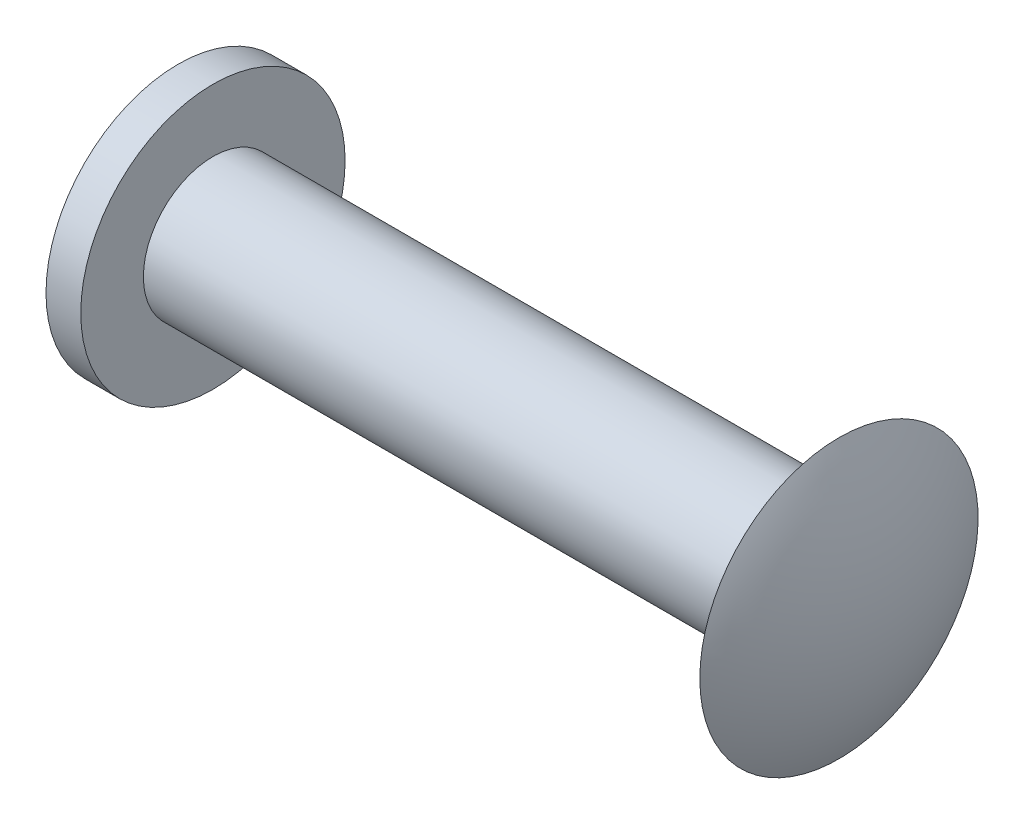
ISO-10303-21;
HEADER;
FILE_DESCRIPTION(('STEP AP214'),'2;1');
FILE_NAME('part.step','',(''),(''),'','','');
FILE_SCHEMA(('AUTOMOTIVE_DESIGN { 1 0 10303 214 1 1 1 1 }'));
ENDSEC;
DATA;
#1=APPLICATION_CONTEXT('core data for automotive mechanical design processes');
#2=APPLICATION_PROTOCOL_DEFINITION('international standard','automotive_design',2000,#1);
#3=PRODUCT_CONTEXT('',#1,'mechanical');
#4=PRODUCT('Part','Part','',(#3));
#5=PRODUCT_RELATED_PRODUCT_CATEGORY('part','',(#4));
#6=PRODUCT_DEFINITION_FORMATION('','',#4);
#7=PRODUCT_DEFINITION_CONTEXT('part definition',#1,'design');
#8=PRODUCT_DEFINITION('design','',#6,#7);
#9=PRODUCT_DEFINITION_SHAPE('','',#8);
#10=(LENGTH_UNIT() NAMED_UNIT(*) SI_UNIT(.MILLI.,.METRE.));
#11=(NAMED_UNIT(*) PLANE_ANGLE_UNIT() SI_UNIT($,.RADIAN.));
#12=(NAMED_UNIT(*) SI_UNIT($,.STERADIAN.) SOLID_ANGLE_UNIT());
#13=UNCERTAINTY_MEASURE_WITH_UNIT(LENGTH_MEASURE(1.E-05),#10,'distance_accuracy_value','');
#14=(GEOMETRIC_REPRESENTATION_CONTEXT(3) GLOBAL_UNCERTAINTY_ASSIGNED_CONTEXT((#13)) GLOBAL_UNIT_ASSIGNED_CONTEXT((#10,
#11,#12)) REPRESENTATION_CONTEXT('',''));
#15=CARTESIAN_POINT('',(0.,0.,0.));
#16=DIRECTION('',(0.,0.,1.));
#17=DIRECTION('',(1.,0.,0.));
#18=AXIS2_PLACEMENT_3D('',#15,#16,#17);
#19=CARTESIAN_POINT('',(0.,0.,0.));
#20=DIRECTION('',(1.,0.,0.));
#21=DIRECTION('',(0.,0.,-1.));
#22=AXIS2_PLACEMENT_3D('',#19,#20,#21);
#23=PLANE('',#22);
#24=CARTESIAN_POINT('',(0.,0.,0.));
#25=DIRECTION('',(-1.,0.,0.));
#26=DIRECTION('',(0.,0.,1.));
#27=AXIS2_PLACEMENT_3D('',#24,#25,#26);
#28=CIRCLE('',#27,1.9);
#29=CARTESIAN_POINT('',(0.,0.,1.9));
#30=VERTEX_POINT('',#29);
#31=EDGE_CURVE('E10',#30,#30,#28,.T.);
#32=ORIENTED_EDGE('',*,*,#31,.T.);
#33=EDGE_LOOP('',(#32));
#34=FACE_BOUND('',#33,.T.);
#35=ADVANCED_FACE('F34',(#34),#23,.F.);
#36=CARTESIAN_POINT('',(9.5,0.,0.));
#37=DIRECTION('',(-1.,0.,0.));
#38=DIRECTION('',(0.,0.,1.));
#39=AXIS2_PLACEMENT_3D('',#36,#37,#38);
#40=CYLINDRICAL_SURFACE('',#39,1.9);
#41=ORIENTED_EDGE('',*,*,#31,.F.);
#42=EDGE_LOOP('',(#41));
#43=FACE_BOUND('',#42,.T.);
#44=CARTESIAN_POINT('',(0.5,0.,0.));
#45=DIRECTION('',(-1.,0.,0.));
#46=DIRECTION('',(0.,0.,1.));
#47=AXIS2_PLACEMENT_3D('',#44,#45,#46);
#48=CIRCLE('',#47,1.9);
#49=CARTESIAN_POINT('',(0.5,0.,1.9));
#50=VERTEX_POINT('',#49);
#51=EDGE_CURVE('E41',#50,#50,#48,.T.);
#52=ORIENTED_EDGE('',*,*,#51,.T.);
#53=EDGE_LOOP('',(#52));
#54=FACE_BOUND('',#53,.T.);
#55=ADVANCED_FACE('F74',(#43,#54),#40,.T.);
#56=CARTESIAN_POINT('',(0.5,1.9,0.));
#57=DIRECTION('',(-1.,0.,0.));
#58=DIRECTION('',(0.,0.,1.));
#59=AXIS2_PLACEMENT_3D('',#56,#57,#58);
#60=PLANE('',#59);
#61=ORIENTED_EDGE('',*,*,#51,.F.);
#62=EDGE_LOOP('',(#61));
#63=FACE_BOUND('',#62,.T.);
#64=CARTESIAN_POINT('',(0.5,0.,0.));
#65=DIRECTION('',(-1.,0.,0.));
#66=DIRECTION('',(0.,0.,1.));
#67=AXIS2_PLACEMENT_3D('',#64,#65,#66);
#68=CIRCLE('',#67,1.);
#69=CARTESIAN_POINT('',(0.5,0.,1.));
#70=VERTEX_POINT('',#69);
#71=EDGE_CURVE('E48',#70,#70,#68,.T.);
#72=ORIENTED_EDGE('',*,*,#71,.T.);
#73=EDGE_LOOP('',(#72));
#74=FACE_BOUND('',#73,.T.);
#75=ADVANCED_FACE('F78',(#63,#74),#60,.F.);
#76=CARTESIAN_POINT('',(9.5,0.,0.));
#77=DIRECTION('',(-1.,0.,0.));
#78=DIRECTION('',(0.,0.,1.));
#79=AXIS2_PLACEMENT_3D('',#76,#77,#78);
#80=CYLINDRICAL_SURFACE('',#79,1.);
#81=ORIENTED_EDGE('',*,*,#71,.F.);
#82=EDGE_LOOP('',(#81));
#83=FACE_BOUND('',#82,.T.);
#84=CARTESIAN_POINT('',(9.5,0.,0.));
#85=DIRECTION('',(-1.,0.,0.));
#86=DIRECTION('',(0.,0.,1.));
#87=AXIS2_PLACEMENT_3D('',#84,#85,#86);
#88=CIRCLE('',#87,1.);
#89=CARTESIAN_POINT('',(9.5,0.,1.));
#90=VERTEX_POINT('',#89);
#91=EDGE_CURVE('E52',#90,#90,#88,.T.);
#92=ORIENTED_EDGE('',*,*,#91,.T.);
#93=EDGE_LOOP('',(#92));
#94=FACE_BOUND('',#93,.T.);
#95=ADVANCED_FACE('F70',(#83,#94),#80,.T.);
#96=CARTESIAN_POINT('',(9.5,1.,0.));
#97=DIRECTION('',(1.,0.,0.));
#98=DIRECTION('',(0.,0.,-1.));
#99=AXIS2_PLACEMENT_3D('',#96,#97,#98);
#100=PLANE('',#99);
#101=ORIENTED_EDGE('',*,*,#91,.F.);
#102=EDGE_LOOP('',(#101));
#103=FACE_BOUND('',#102,.T.);
#104=CARTESIAN_POINT('',(9.5,0.,0.));
#105=DIRECTION('',(-1.,0.,0.));
#106=DIRECTION('',(0.,0.,1.));
#107=AXIS2_PLACEMENT_3D('',#104,#105,#106);
#108=CIRCLE('',#107,2.);
#109=CARTESIAN_POINT('',(9.5,0.,2.));
#110=VERTEX_POINT('',#109);
#111=EDGE_CURVE('E57',#110,#110,#108,.T.);
#112=ORIENTED_EDGE('',*,*,#111,.T.);
#113=EDGE_LOOP('',(#112));
#114=FACE_BOUND('',#113,.T.);
#115=ADVANCED_FACE('F62',(#103,#114),#100,.F.);
#116=CARTESIAN_POINT('',(5.75000000000002,0.,0.));
#117=DIRECTION('',(-1.,0.,0.));
#118=DIRECTION('',(0.,1.,0.));
#119=AXIS2_PLACEMENT_3D('',#116,#117,#118);
#120=SPHERICAL_SURFACE('',#119,4.24999999999998);
#121=ORIENTED_EDGE('',*,*,#111,.F.);
#122=EDGE_LOOP('',(#121));
#123=FACE_BOUND('',#122,.T.);
#124=ADVANCED_FACE('F64',(#123),#120,.T.);
#125=CLOSED_SHELL('',(#35,#55,#75,#95,#115,#124));
#126=MANIFOLD_SOLID_BREP('B2',#125);
#127=ADVANCED_BREP_SHAPE_REPRESENTATION('',(#18,#126),#14);
#128=SHAPE_DEFINITION_REPRESENTATION(#9,#127);
ENDSEC;
END-ISO-10303-21;
